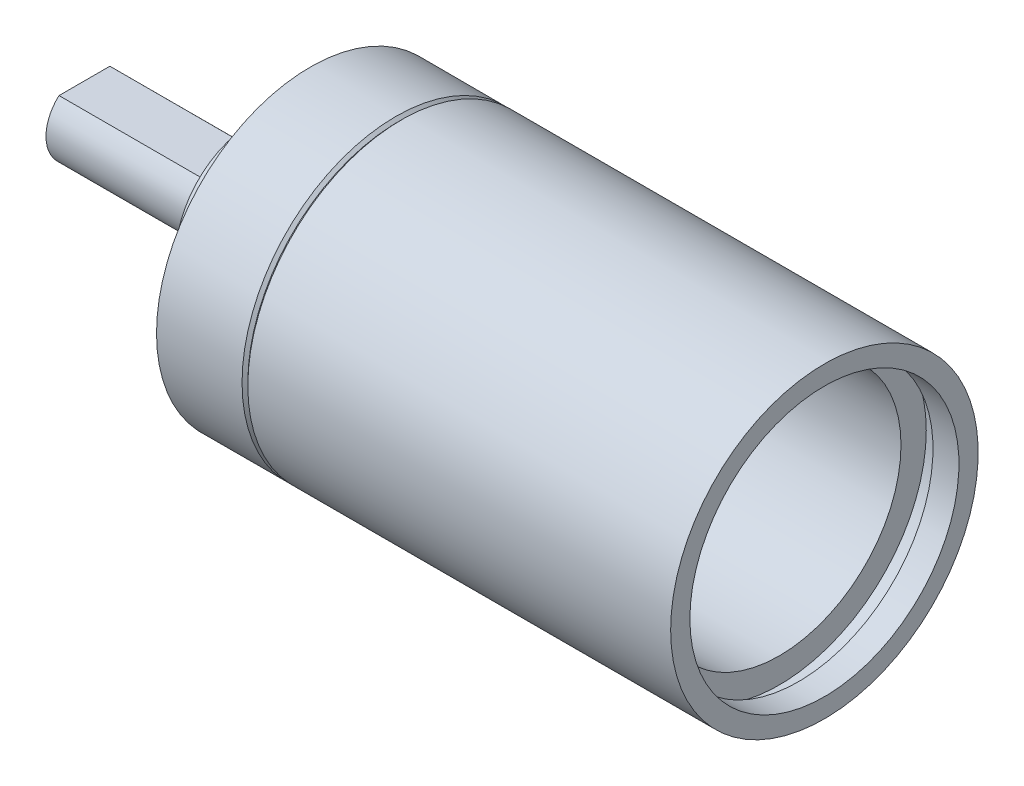
ISO-10303-21;
HEADER;
FILE_DESCRIPTION(('STEP AP214'),'2;1');
FILE_NAME('part.step','',(''),(''),'','','');
FILE_SCHEMA(('AUTOMOTIVE_DESIGN { 1 0 10303 214 1 1 1 1 }'));
ENDSEC;
DATA;
#1=APPLICATION_CONTEXT('core data for automotive mechanical design processes');
#2=APPLICATION_PROTOCOL_DEFINITION('international standard','automotive_design',2000,#1);
#3=PRODUCT_CONTEXT('',#1,'mechanical');
#4=PRODUCT('Part','Part','',(#3));
#5=PRODUCT_RELATED_PRODUCT_CATEGORY('part','',(#4));
#6=PRODUCT_DEFINITION_FORMATION('','',#4);
#7=PRODUCT_DEFINITION_CONTEXT('part definition',#1,'design');
#8=PRODUCT_DEFINITION('design','',#6,#7);
#9=PRODUCT_DEFINITION_SHAPE('','',#8);
#10=(LENGTH_UNIT() NAMED_UNIT(*) SI_UNIT(.MILLI.,.METRE.));
#11=(NAMED_UNIT(*) PLANE_ANGLE_UNIT() SI_UNIT($,.RADIAN.));
#12=(NAMED_UNIT(*) SI_UNIT($,.STERADIAN.) SOLID_ANGLE_UNIT());
#13=UNCERTAINTY_MEASURE_WITH_UNIT(LENGTH_MEASURE(1.E-05),#10,'distance_accuracy_value','');
#14=(GEOMETRIC_REPRESENTATION_CONTEXT(3) GLOBAL_UNCERTAINTY_ASSIGNED_CONTEXT((#13)) GLOBAL_UNIT_ASSIGNED_CONTEXT((#10,
#11,#12)) REPRESENTATION_CONTEXT('',''));
#15=CARTESIAN_POINT('',(0.,0.,0.));
#16=DIRECTION('',(0.,0.,1.));
#17=DIRECTION('',(1.,0.,0.));
#18=AXIS2_PLACEMENT_3D('',#15,#16,#17);
#19=CARTESIAN_POINT('',(-38.5000000000001,0.,0.));
#20=DIRECTION('',(-1.,0.,0.));
#21=DIRECTION('',(0.,0.,1.));
#22=AXIS2_PLACEMENT_3D('',#19,#20,#21);
#23=PLANE('',#22);
#24=CARTESIAN_POINT('',(-38.5000000000001,0.,0.));
#25=DIRECTION('',(-1.,0.,0.));
#26=DIRECTION('',(0.,0.,1.));
#27=AXIS2_PLACEMENT_3D('',#24,#25,#26);
#28=CIRCLE('',#27,2.);
#29=CARTESIAN_POINT('',(-38.5,1.50000000000003,1.32287565553226));
#30=VERTEX_POINT('',#29);
#31=CARTESIAN_POINT('',(-38.5,1.50000000000002,-1.32287565553225));
#32=VERTEX_POINT('',#31);
#33=EDGE_CURVE('E18',#30,#32,#28,.F.);
#34=ORIENTED_EDGE('',*,*,#33,.F.);
#35=DIRECTION('',(0.,0.,-1.));
#36=VECTOR('',#35,1.);
#37=CARTESIAN_POINT('',(-38.5,1.5,5.));
#38=LINE('',#37,#36);
#39=EDGE_CURVE('E56',#30,#32,#38,.T.);
#40=ORIENTED_EDGE('',*,*,#39,.T.);
#41=EDGE_LOOP('',(#34,#40));
#42=FACE_BOUND('',#41,.T.);
#43=ADVANCED_FACE('F15',(#42),#23,.T.);
#44=CARTESIAN_POINT('',(-30.5,1.5,5.));
#45=DIRECTION('',(0.707106781186547,-0.707106781186548,0.));
#46=DIRECTION('',(0.707106781186548,0.707106781186547,0.));
#47=AXIS2_PLACEMENT_3D('',#44,#45,#46);
#48=PLANE('',#47);
#49=DIRECTION('',(0.,0.,-1.));
#50=VECTOR('',#49,1.);
#51=CARTESIAN_POINT('',(-30.5,1.5,5.));
#52=LINE('',#51,#50);
#53=CARTESIAN_POINT('',(-30.4999999999999,1.50000000000004,-1.32287565553225));
#54=VERTEX_POINT('',#53);
#55=CARTESIAN_POINT('',(-30.4999999999999,1.50000000000003,1.32287565553226));
#56=VERTEX_POINT('',#55);
#57=EDGE_CURVE('E67',#54,#56,#52,.F.);
#58=ORIENTED_EDGE('',*,*,#57,.T.);
#59=CARTESIAN_POINT('',(-32.,0.,0.));
#60=DIRECTION('',(0.707106781186547,-0.707106781186548,0.));
#61=DIRECTION('',(-0.707106781186548,-0.707106781186547,0.));
#62=AXIS2_PLACEMENT_3D('',#59,#60,#61);
#63=ELLIPSE('',#62,2.82842712474619,2.);
#64=EDGE_CURVE('E71',#54,#56,#63,.T.);
#65=ORIENTED_EDGE('',*,*,#64,.F.);
#66=EDGE_LOOP('',(#58,#65));
#67=FACE_BOUND('',#66,.T.);
#68=ADVANCED_FACE('F154',(#67),#48,.F.);
#69=CARTESIAN_POINT('',(-38.5,1.5,5.));
#70=DIRECTION('',(0.,-1.,0.));
#71=DIRECTION('',(0.,0.,-1.));
#72=AXIS2_PLACEMENT_3D('',#69,#70,#71);
#73=PLANE('',#72);
#74=ORIENTED_EDGE('',*,*,#39,.F.);
#75=DIRECTION('',(-1.,0.,0.));
#76=VECTOR('',#75,1.);
#77=CARTESIAN_POINT('',(1.92499999999995,1.50000000000007,1.32287565553222));
#78=LINE('',#77,#76);
#79=EDGE_CURVE('E65',#56,#30,#78,.T.);
#80=ORIENTED_EDGE('',*,*,#79,.F.);
#81=ORIENTED_EDGE('',*,*,#57,.F.);
#82=DIRECTION('',(-1.,0.,0.));
#83=VECTOR('',#82,1.);
#84=CARTESIAN_POINT('',(1.92499999999995,1.50000000000007,-1.32287565553221));
#85=LINE('',#84,#83);
#86=EDGE_CURVE('E61',#32,#54,#85,.F.);
#87=ORIENTED_EDGE('',*,*,#86,.F.);
#88=EDGE_LOOP('',(#74,#80,#81,#87));
#89=FACE_BOUND('',#88,.T.);
#90=ADVANCED_FACE('F64',(#89),#73,.F.);
#91=CARTESIAN_POINT('',(1.92499999999995,0.,0.));
#92=DIRECTION('',(-1.,0.,0.));
#93=DIRECTION('',(0.,0.,1.));
#94=AXIS2_PLACEMENT_3D('',#91,#92,#93);
#95=CYLINDRICAL_SURFACE('',#94,2.);
#96=CARTESIAN_POINT('',(-29.7500000000001,0.,0.));
#97=DIRECTION('',(-1.,0.,0.));
#98=DIRECTION('',(0.,0.,1.));
#99=AXIS2_PLACEMENT_3D('',#96,#97,#98);
#100=CIRCLE('',#99,2.);
#101=CARTESIAN_POINT('',(-29.7500000000001,0.,2.00000000000001));
#102=VERTEX_POINT('',#101);
#103=EDGE_CURVE('E72',#102,#102,#100,.F.);
#104=ORIENTED_EDGE('',*,*,#103,.F.);
#105=EDGE_LOOP('',(#104));
#106=FACE_BOUND('',#105,.T.);
#107=ORIENTED_EDGE('',*,*,#79,.T.);
#108=ORIENTED_EDGE('',*,*,#33,.T.);
#109=ORIENTED_EDGE('',*,*,#86,.T.);
#110=ORIENTED_EDGE('',*,*,#64,.T.);
#111=EDGE_LOOP('',(#107,#108,#109,#110));
#112=FACE_BOUND('',#111,.T.);
#113=ADVANCED_FACE('F69',(#106,#112),#95,.T.);
#114=CARTESIAN_POINT('',(-29.7500000000001,0.,0.));
#115=DIRECTION('',(-1.,0.,0.));
#116=DIRECTION('',(0.,0.,1.));
#117=AXIS2_PLACEMENT_3D('',#114,#115,#116);
#118=PLANE('',#117);
#119=CARTESIAN_POINT('',(-29.7500000000001,0.,0.));
#120=DIRECTION('',(-1.,0.,0.));
#121=DIRECTION('',(0.,0.,1.));
#122=AXIS2_PLACEMENT_3D('',#119,#120,#121);
#123=CIRCLE('',#122,4.);
#124=CARTESIAN_POINT('',(-29.7500000000001,0.,4.00000000000001));
#125=VERTEX_POINT('',#124);
#126=EDGE_CURVE('E75',#125,#125,#123,.F.);
#127=ORIENTED_EDGE('',*,*,#126,.F.);
#128=EDGE_LOOP('',(#127));
#129=FACE_BOUND('',#128,.T.);
#130=ORIENTED_EDGE('',*,*,#103,.T.);
#131=EDGE_LOOP('',(#130));
#132=FACE_BOUND('',#131,.T.);
#133=ADVANCED_FACE('F141',(#129,#132),#118,.T.);
#134=CARTESIAN_POINT('',(-21.7000000000001,0.,0.));
#135=DIRECTION('',(-1.,0.,0.));
#136=DIRECTION('',(0.,0.,1.));
#137=AXIS2_PLACEMENT_3D('',#134,#135,#136);
#138=PLANE('',#137);
#139=CARTESIAN_POINT('',(-21.7000000000001,0.,0.));
#140=DIRECTION('',(-1.,0.,0.));
#141=DIRECTION('',(0.,0.,1.));
#142=AXIS2_PLACEMENT_3D('',#139,#140,#141);
#143=CIRCLE('',#142,6.335);
#144=CARTESIAN_POINT('',(-21.7000000000001,0.,6.335));
#145=VERTEX_POINT('',#144);
#146=EDGE_CURVE('E133',#145,#145,#143,.F.);
#147=ORIENTED_EDGE('',*,*,#146,.T.);
#148=EDGE_LOOP('',(#147));
#149=FACE_BOUND('',#148,.T.);
#150=ADVANCED_FACE('F144',(#149),#138,.F.);
#151=CARTESIAN_POINT('',(1.92499999999995,0.,0.));
#152=DIRECTION('',(-1.,0.,0.));
#153=DIRECTION('',(0.,0.,1.));
#154=AXIS2_PLACEMENT_3D('',#151,#152,#153);
#155=CYLINDRICAL_SURFACE('',#154,4.);
#156=CARTESIAN_POINT('',(-27.9,0.,0.));
#157=DIRECTION('',(-1.,0.,0.));
#158=DIRECTION('',(0.,0.,1.));
#159=AXIS2_PLACEMENT_3D('',#156,#157,#158);
#160=CIRCLE('',#159,4.);
#161=CARTESIAN_POINT('',(-27.9,0.,4.00000000000001));
#162=VERTEX_POINT('',#161);
#163=EDGE_CURVE('E130',#162,#162,#160,.F.);
#164=ORIENTED_EDGE('',*,*,#163,.F.);
#165=EDGE_LOOP('',(#164));
#166=FACE_BOUND('',#165,.T.);
#167=ORIENTED_EDGE('',*,*,#126,.T.);
#168=EDGE_LOOP('',(#167));
#169=FACE_BOUND('',#168,.T.);
#170=ADVANCED_FACE('F139',(#166,#169),#155,.T.);
#171=CARTESIAN_POINT('',(1.92499999999995,0.,0.));
#172=DIRECTION('',(-1.,0.,0.));
#173=DIRECTION('',(0.,0.,1.));
#174=AXIS2_PLACEMENT_3D('',#171,#172,#173);
#175=CYLINDRICAL_SURFACE('',#174,6.335);
#176=CARTESIAN_POINT('',(-2.35000000000002,0.,0.));
#177=DIRECTION('',(-1.,0.,0.));
#178=DIRECTION('',(0.,0.,1.));
#179=AXIS2_PLACEMENT_3D('',#176,#177,#178);
#180=CIRCLE('',#179,6.335);
#181=CARTESIAN_POINT('',(-2.35000000000002,0.,6.33500000000001));
#182=VERTEX_POINT('',#181);
#183=EDGE_CURVE('E127',#182,#182,#180,.F.);
#184=ORIENTED_EDGE('',*,*,#183,.T.);
#185=EDGE_LOOP('',(#184));
#186=FACE_BOUND('',#185,.T.);
#187=ORIENTED_EDGE('',*,*,#146,.F.);
#188=EDGE_LOOP('',(#187));
#189=FACE_BOUND('',#188,.T.);
#190=ADVANCED_FACE('F254',(#186,#189),#175,.F.);
#191=CARTESIAN_POINT('',(-22.872748738564,3.25,5.629165124599));
#192=DIRECTION('',(-1.,0.,0.));
#193=DIRECTION('',(0.,0.,1.));
#194=AXIS2_PLACEMENT_3D('',#191,#192,#193);
#195=CONICAL_SURFACE('',#194,0.870000000002384,1.02974425843473);
#196=CARTESIAN_POINT('',(-22.349999999733,3.25,5.62916512447487));
#197=VERTEX_POINT('',#196);
#198=VERTEX_LOOP('',#197);
#199=FACE_BOUND('',#198,.T.);
#200=CARTESIAN_POINT('',(-22.8727487385501,3.25,5.629165124599));
#201=DIRECTION('',(1.,0.,0.));
#202=DIRECTION('',(0.,0.,-1.));
#203=AXIS2_PLACEMENT_3D('',#200,#201,#202);
#204=CIRCLE('',#203,0.87);
#205=CARTESIAN_POINT('',(-22.8727487385501,3.25,4.759165124599));
#206=VERTEX_POINT('',#205);
#207=EDGE_CURVE('E79',#206,#206,#204,.F.);
#208=ORIENTED_EDGE('',*,*,#207,.T.);
#209=EDGE_LOOP('',(#208));
#210=FACE_BOUND('',#209,.T.);
#211=ADVANCED_FACE('F250',(#199,#210),#195,.F.);
#212=CARTESIAN_POINT('',(-22.872748738564,-3.25,5.62916512459901));
#213=DIRECTION('',(-1.,0.,0.));
#214=DIRECTION('',(0.,0.,1.));
#215=AXIS2_PLACEMENT_3D('',#212,#213,#214);
#216=CONICAL_SURFACE('',#215,0.870000000002387,1.02974425843474);
#217=CARTESIAN_POINT('',(-22.349999999733,-3.25,5.62916512459901));
#218=VERTEX_POINT('',#217);
#219=VERTEX_LOOP('',#218);
#220=FACE_BOUND('',#219,.T.);
#221=CARTESIAN_POINT('',(-22.8727487385501,-3.25000000000001,5.629165124599));
#222=DIRECTION('',(1.,0.,0.));
#223=DIRECTION('',(0.,0.,-1.));
#224=AXIS2_PLACEMENT_3D('',#221,#222,#223);
#225=CIRCLE('',#224,0.87);
#226=CARTESIAN_POINT('',(-22.8727487385501,-3.25000000000001,4.759165124599));
#227=VERTEX_POINT('',#226);
#228=EDGE_CURVE('E507',#227,#227,#225,.F.);
#229=ORIENTED_EDGE('',*,*,#228,.T.);
#230=EDGE_LOOP('',(#229));
#231=FACE_BOUND('',#230,.T.);
#232=ADVANCED_FACE('F246',(#220,#231),#216,.F.);
#233=CARTESIAN_POINT('',(-22.8727487385072,-6.5,0.));
#234=DIRECTION('',(-1.,0.,0.));
#235=DIRECTION('',(0.,0.,1.));
#236=AXIS2_PLACEMENT_3D('',#233,#234,#235);
#237=CONICAL_SURFACE('',#236,0.869999999906668,1.02974425821274);
#238=CARTESIAN_POINT('',(-22.3499999996193,-6.5,0.));
#239=VERTEX_POINT('',#238);
#240=VERTEX_LOOP('',#239);
#241=FACE_BOUND('',#240,.T.);
#242=CARTESIAN_POINT('',(-22.8727487385501,-6.5,0.));
#243=DIRECTION('',(1.,0.,0.));
#244=DIRECTION('',(0.,0.,-1.));
#245=AXIS2_PLACEMENT_3D('',#242,#243,#244);
#246=CIRCLE('',#245,0.87);
#247=CARTESIAN_POINT('',(-22.8727487385501,-6.5,-0.869999999999986));
#248=VERTEX_POINT('',#247);
#249=EDGE_CURVE('E509',#248,#248,#246,.F.);
#250=ORIENTED_EDGE('',*,*,#249,.T.);
#251=EDGE_LOOP('',(#250));
#252=FACE_BOUND('',#251,.T.);
#253=ADVANCED_FACE('F242',(#241,#252),#237,.F.);
#254=CARTESIAN_POINT('',(-22.8727487386209,-3.25,-5.62916512459899));
#255=DIRECTION('',(-1.,0.,0.));
#256=DIRECTION('',(0.,0.,1.));
#257=AXIS2_PLACEMENT_3D('',#254,#255,#256);
#258=CONICAL_SURFACE('',#257,0.869999999981497,1.02974425833669);
#259=CARTESIAN_POINT('',(-22.3499999997614,-3.25,-5.62916512467382));
#260=VERTEX_POINT('',#259);
#261=VERTEX_LOOP('',#260);
#262=FACE_BOUND('',#261,.T.);
#263=CARTESIAN_POINT('',(-22.8727487385501,-3.25000000000001,-5.629165124599));
#264=DIRECTION('',(1.,0.,0.));
#265=DIRECTION('',(0.,0.,-1.));
#266=AXIS2_PLACEMENT_3D('',#263,#264,#265);
#267=CIRCLE('',#266,0.87);
#268=CARTESIAN_POINT('',(-22.8727487385501,-3.25000000000001,-6.499165124599));
#269=VERTEX_POINT('',#268);
#270=EDGE_CURVE('E513',#269,#269,#267,.F.);
#271=ORIENTED_EDGE('',*,*,#270,.T.);
#272=EDGE_LOOP('',(#271));
#273=FACE_BOUND('',#272,.T.);
#274=ADVANCED_FACE('F238',(#262,#273),#258,.F.);
#275=CARTESIAN_POINT('',(-22.8727487386209,3.25,-5.629165124599));
#276=DIRECTION('',(-1.,0.,0.));
#277=DIRECTION('',(0.,0.,1.));
#278=AXIS2_PLACEMENT_3D('',#275,#276,#277);
#279=CONICAL_SURFACE('',#278,0.86999999998149,1.02974425833668);
#280=CARTESIAN_POINT('',(-22.3499999997898,3.25,-5.629165124599));
#281=VERTEX_POINT('',#280);
#282=VERTEX_LOOP('',#281);
#283=FACE_BOUND('',#282,.T.);
#284=CARTESIAN_POINT('',(-22.8727487385501,3.25,-5.62916512459898));
#285=DIRECTION('',(1.,0.,0.));
#286=DIRECTION('',(0.,0.,-1.));
#287=AXIS2_PLACEMENT_3D('',#284,#285,#286);
#288=CIRCLE('',#287,0.87);
#289=CARTESIAN_POINT('',(-22.8727487385501,3.25,-6.49916512459898));
#290=VERTEX_POINT('',#289);
#291=EDGE_CURVE('E518',#290,#290,#288,.F.);
#292=ORIENTED_EDGE('',*,*,#291,.T.);
#293=EDGE_LOOP('',(#292));
#294=FACE_BOUND('',#293,.T.);
#295=ADVANCED_FACE('F235',(#283,#294),#279,.F.);
#296=CARTESIAN_POINT('',(-22.8727487385072,6.5,0.));
#297=DIRECTION('',(-1.,0.,0.));
#298=DIRECTION('',(0.,0.,1.));
#299=AXIS2_PLACEMENT_3D('',#296,#297,#298);
#300=CONICAL_SURFACE('',#299,0.869999999906675,1.02974425821274);
#301=CARTESIAN_POINT('',(-22.3499999995909,6.5,5.68503758913403E-11));
#302=VERTEX_POINT('',#301);
#303=VERTEX_LOOP('',#302);
#304=FACE_BOUND('',#303,.T.);
#305=CARTESIAN_POINT('',(-22.8727487385501,6.5,0.));
#306=DIRECTION('',(1.,0.,0.));
#307=DIRECTION('',(0.,0.,-1.));
#308=AXIS2_PLACEMENT_3D('',#305,#306,#307);
#309=CIRCLE('',#308,0.87);
#310=CARTESIAN_POINT('',(-22.8727487385501,6.5,-0.869999999999993));
#311=VERTEX_POINT('',#310);
#312=EDGE_CURVE('E126',#311,#311,#309,.F.);
#313=ORIENTED_EDGE('',*,*,#312,.T.);
#314=EDGE_LOOP('',(#313));
#315=FACE_BOUND('',#314,.T.);
#316=ADVANCED_FACE('F231',(#304,#315),#300,.F.);
#317=CARTESIAN_POINT('',(-27.9,0.,0.));
#318=DIRECTION('',(-1.,0.,0.));
#319=DIRECTION('',(0.,0.,1.));
#320=AXIS2_PLACEMENT_3D('',#317,#318,#319);
#321=PLANE('',#320);
#322=CARTESIAN_POINT('',(-27.9,0.,0.));
#323=DIRECTION('',(-1.,0.,0.));
#324=DIRECTION('',(0.,0.,1.));
#325=AXIS2_PLACEMENT_3D('',#322,#323,#324);
#326=CIRCLE('',#325,5.);
#327=CARTESIAN_POINT('',(-27.9,0.,5.00000000000001));
#328=VERTEX_POINT('',#327);
#329=EDGE_CURVE('E123',#328,#328,#326,.F.);
#330=ORIENTED_EDGE('',*,*,#329,.F.);
#331=EDGE_LOOP('',(#330));
#332=FACE_BOUND('',#331,.T.);
#333=ORIENTED_EDGE('',*,*,#163,.T.);
#334=EDGE_LOOP('',(#333));
#335=FACE_BOUND('',#334,.T.);
#336=ADVANCED_FACE('F227',(#332,#335),#321,.T.);
#337=CARTESIAN_POINT('',(-2.35000000000002,0.,0.));
#338=DIRECTION('',(-1.,0.,0.));
#339=DIRECTION('',(0.,0.,1.));
#340=AXIS2_PLACEMENT_3D('',#337,#338,#339);
#341=PLANE('',#340);
#342=CARTESIAN_POINT('',(-2.35000000000002,0.,0.));
#343=DIRECTION('',(-1.,0.,0.));
#344=DIRECTION('',(0.,0.,1.));
#345=AXIS2_PLACEMENT_3D('',#342,#343,#344);
#346=CIRCLE('',#345,7.65);
#347=CARTESIAN_POINT('',(-2.35000000000002,0.,7.65000000000001));
#348=VERTEX_POINT('',#347);
#349=EDGE_CURVE('E120',#348,#348,#346,.F.);
#350=ORIENTED_EDGE('',*,*,#349,.T.);
#351=EDGE_LOOP('',(#350));
#352=FACE_BOUND('',#351,.T.);
#353=ORIENTED_EDGE('',*,*,#183,.F.);
#354=EDGE_LOOP('',(#353));
#355=FACE_BOUND('',#354,.T.);
#356=ADVANCED_FACE('F223',(#352,#355),#341,.F.);
#357=CARTESIAN_POINT('',(-26.97,3.25,5.629165124599));
#358=DIRECTION('',(1.,0.,0.));
#359=DIRECTION('',(0.,0.,-1.));
#360=AXIS2_PLACEMENT_3D('',#357,#358,#359);
#361=CYLINDRICAL_SURFACE('',#360,0.87);
#362=CARTESIAN_POINT('',(-26.75,3.25,5.629165124599));
#363=DIRECTION('',(1.,0.,0.));
#364=DIRECTION('',(0.,0.,-1.));
#365=AXIS2_PLACEMENT_3D('',#362,#363,#364);
#366=CIRCLE('',#365,0.87);
#367=CARTESIAN_POINT('',(-26.75,3.25,4.759165124599));
#368=VERTEX_POINT('',#367);
#369=EDGE_CURVE('E117',#368,#368,#366,.T.);
#370=ORIENTED_EDGE('',*,*,#369,.F.);
#371=EDGE_LOOP('',(#370));
#372=FACE_BOUND('',#371,.T.);
#373=ORIENTED_EDGE('',*,*,#207,.F.);
#374=EDGE_LOOP('',(#373));
#375=FACE_BOUND('',#374,.T.);
#376=ADVANCED_FACE('F219',(#372,#375),#361,.F.);
#377=CARTESIAN_POINT('',(-26.97,-3.25000000000001,5.629165124599));
#378=DIRECTION('',(1.,0.,0.));
#379=DIRECTION('',(0.,0.,-1.));
#380=AXIS2_PLACEMENT_3D('',#377,#378,#379);
#381=CYLINDRICAL_SURFACE('',#380,0.87);
#382=CARTESIAN_POINT('',(-26.75,-3.25000000000001,5.629165124599));
#383=DIRECTION('',(1.,0.,0.));
#384=DIRECTION('',(0.,0.,-1.));
#385=AXIS2_PLACEMENT_3D('',#382,#383,#384);
#386=CIRCLE('',#385,0.87);
#387=CARTESIAN_POINT('',(-26.75,-3.25000000000001,4.759165124599));
#388=VERTEX_POINT('',#387);
#389=EDGE_CURVE('E114',#388,#388,#386,.T.);
#390=ORIENTED_EDGE('',*,*,#389,.F.);
#391=EDGE_LOOP('',(#390));
#392=FACE_BOUND('',#391,.T.);
#393=ORIENTED_EDGE('',*,*,#228,.F.);
#394=EDGE_LOOP('',(#393));
#395=FACE_BOUND('',#394,.T.);
#396=ADVANCED_FACE('F215',(#392,#395),#381,.F.);
#397=CARTESIAN_POINT('',(-26.97,-6.5,0.));
#398=DIRECTION('',(1.,0.,0.));
#399=DIRECTION('',(0.,0.,-1.));
#400=AXIS2_PLACEMENT_3D('',#397,#398,#399);
#401=CYLINDRICAL_SURFACE('',#400,0.87);
#402=CARTESIAN_POINT('',(-26.75,-6.5,0.));
#403=DIRECTION('',(1.,0.,0.));
#404=DIRECTION('',(0.,0.,-1.));
#405=AXIS2_PLACEMENT_3D('',#402,#403,#404);
#406=CIRCLE('',#405,0.87);
#407=CARTESIAN_POINT('',(-26.75,-6.5,-0.869999999999986));
#408=VERTEX_POINT('',#407);
#409=EDGE_CURVE('E111',#408,#408,#406,.T.);
#410=ORIENTED_EDGE('',*,*,#409,.F.);
#411=EDGE_LOOP('',(#410));
#412=FACE_BOUND('',#411,.T.);
#413=ORIENTED_EDGE('',*,*,#249,.F.);
#414=EDGE_LOOP('',(#413));
#415=FACE_BOUND('',#414,.T.);
#416=ADVANCED_FACE('F211',(#412,#415),#401,.F.);
#417=CARTESIAN_POINT('',(-26.97,-3.25000000000001,-5.629165124599));
#418=DIRECTION('',(1.,0.,0.));
#419=DIRECTION('',(0.,0.,-1.));
#420=AXIS2_PLACEMENT_3D('',#417,#418,#419);
#421=CYLINDRICAL_SURFACE('',#420,0.87);
#422=CARTESIAN_POINT('',(-26.75,-3.25000000000001,-5.629165124599));
#423=DIRECTION('',(1.,0.,0.));
#424=DIRECTION('',(0.,0.,-1.));
#425=AXIS2_PLACEMENT_3D('',#422,#423,#424);
#426=CIRCLE('',#425,0.87);
#427=CARTESIAN_POINT('',(-26.75,-3.25000000000001,-6.499165124599));
#428=VERTEX_POINT('',#427);
#429=EDGE_CURVE('E108',#428,#428,#426,.T.);
#430=ORIENTED_EDGE('',*,*,#429,.F.);
#431=EDGE_LOOP('',(#430));
#432=FACE_BOUND('',#431,.T.);
#433=ORIENTED_EDGE('',*,*,#270,.F.);
#434=EDGE_LOOP('',(#433));
#435=FACE_BOUND('',#434,.T.);
#436=ADVANCED_FACE('F207',(#432,#435),#421,.F.);
#437=CARTESIAN_POINT('',(-26.97,3.25,-5.62916512459898));
#438=DIRECTION('',(1.,0.,0.));
#439=DIRECTION('',(0.,0.,-1.));
#440=AXIS2_PLACEMENT_3D('',#437,#438,#439);
#441=CYLINDRICAL_SURFACE('',#440,0.87);
#442=CARTESIAN_POINT('',(-26.75,3.25,-5.62916512459898));
#443=DIRECTION('',(1.,0.,0.));
#444=DIRECTION('',(0.,0.,-1.));
#445=AXIS2_PLACEMENT_3D('',#442,#443,#444);
#446=CIRCLE('',#445,0.87);
#447=CARTESIAN_POINT('',(-26.75,3.25,-6.49916512459898));
#448=VERTEX_POINT('',#447);
#449=EDGE_CURVE('E105',#448,#448,#446,.T.);
#450=ORIENTED_EDGE('',*,*,#449,.F.);
#451=EDGE_LOOP('',(#450));
#452=FACE_BOUND('',#451,.T.);
#453=ORIENTED_EDGE('',*,*,#291,.F.);
#454=EDGE_LOOP('',(#453));
#455=FACE_BOUND('',#454,.T.);
#456=ADVANCED_FACE('F203',(#452,#455),#441,.F.);
#457=CARTESIAN_POINT('',(-26.97,6.5,0.));
#458=DIRECTION('',(1.,0.,0.));
#459=DIRECTION('',(0.,0.,-1.));
#460=AXIS2_PLACEMENT_3D('',#457,#458,#459);
#461=CYLINDRICAL_SURFACE('',#460,0.87);
#462=CARTESIAN_POINT('',(-26.75,6.5,0.));
#463=DIRECTION('',(1.,0.,0.));
#464=DIRECTION('',(0.,0.,-1.));
#465=AXIS2_PLACEMENT_3D('',#462,#463,#464);
#466=CIRCLE('',#465,0.87);
#467=CARTESIAN_POINT('',(-26.75,6.5,-0.869999999999993));
#468=VERTEX_POINT('',#467);
#469=EDGE_CURVE('E102',#468,#468,#466,.T.);
#470=ORIENTED_EDGE('',*,*,#469,.F.);
#471=EDGE_LOOP('',(#470));
#472=FACE_BOUND('',#471,.T.);
#473=ORIENTED_EDGE('',*,*,#312,.F.);
#474=EDGE_LOOP('',(#473));
#475=FACE_BOUND('',#474,.T.);
#476=ADVANCED_FACE('F199',(#472,#475),#461,.F.);
#477=CARTESIAN_POINT('',(1.92499999999995,0.,0.));
#478=DIRECTION('',(-1.,0.,0.));
#479=DIRECTION('',(0.,0.,1.));
#480=AXIS2_PLACEMENT_3D('',#477,#478,#479);
#481=CYLINDRICAL_SURFACE('',#480,5.);
#482=CARTESIAN_POINT('',(-26.75,0.,0.));
#483=DIRECTION('',(-1.,0.,0.));
#484=DIRECTION('',(0.,0.,1.));
#485=AXIS2_PLACEMENT_3D('',#482,#483,#484);
#486=CIRCLE('',#485,5.);
#487=CARTESIAN_POINT('',(-26.75,0.,5.00000000000001));
#488=VERTEX_POINT('',#487);
#489=EDGE_CURVE('E99',#488,#488,#486,.F.);
#490=ORIENTED_EDGE('',*,*,#489,.F.);
#491=EDGE_LOOP('',(#490));
#492=FACE_BOUND('',#491,.T.);
#493=ORIENTED_EDGE('',*,*,#329,.T.);
#494=EDGE_LOOP('',(#493));
#495=FACE_BOUND('',#494,.T.);
#496=ADVANCED_FACE('F195',(#492,#495),#481,.T.);
#497=CARTESIAN_POINT('',(1.92499999999995,0.,0.));
#498=DIRECTION('',(-1.,0.,0.));
#499=DIRECTION('',(0.,0.,1.));
#500=AXIS2_PLACEMENT_3D('',#497,#498,#499);
#501=CYLINDRICAL_SURFACE('',#500,7.65);
#502=CARTESIAN_POINT('',(-1.35000000000002,0.,0.));
#503=DIRECTION('',(-1.,0.,0.));
#504=DIRECTION('',(0.,0.,1.));
#505=AXIS2_PLACEMENT_3D('',#502,#503,#504);
#506=CIRCLE('',#505,7.65);
#507=CARTESIAN_POINT('',(-1.35000000000002,0.,7.65000000000001));
#508=VERTEX_POINT('',#507);
#509=EDGE_CURVE('E96',#508,#508,#506,.T.);
#510=ORIENTED_EDGE('',*,*,#509,.F.);
#511=EDGE_LOOP('',(#510));
#512=FACE_BOUND('',#511,.T.);
#513=ORIENTED_EDGE('',*,*,#349,.F.);
#514=EDGE_LOOP('',(#513));
#515=FACE_BOUND('',#514,.T.);
#516=ADVANCED_FACE('F191',(#512,#515),#501,.F.);
#517=CARTESIAN_POINT('',(-26.75,0.,0.));
#518=DIRECTION('',(-1.,0.,0.));
#519=DIRECTION('',(0.,0.,1.));
#520=AXIS2_PLACEMENT_3D('',#517,#518,#519);
#521=PLANE('',#520);
#522=CARTESIAN_POINT('',(-26.75,0.,0.));
#523=DIRECTION('',(-1.,0.,0.));
#524=DIRECTION('',(0.,0.,1.));
#525=AXIS2_PLACEMENT_3D('',#522,#523,#524);
#526=CIRCLE('',#525,8.);
#527=CARTESIAN_POINT('',(-26.75,0.,8.));
#528=VERTEX_POINT('',#527);
#529=EDGE_CURVE('E93',#528,#528,#526,.F.);
#530=ORIENTED_EDGE('',*,*,#529,.F.);
#531=EDGE_LOOP('',(#530));
#532=FACE_BOUND('',#531,.T.);
#533=ORIENTED_EDGE('',*,*,#489,.T.);
#534=EDGE_LOOP('',(#533));
#535=FACE_BOUND('',#534,.T.);
#536=ORIENTED_EDGE('',*,*,#469,.T.);
#537=EDGE_LOOP('',(#536));
#538=FACE_BOUND('',#537,.T.);
#539=ORIENTED_EDGE('',*,*,#449,.T.);
#540=EDGE_LOOP('',(#539));
#541=FACE_BOUND('',#540,.T.);
#542=ORIENTED_EDGE('',*,*,#429,.T.);
#543=EDGE_LOOP('',(#542));
#544=FACE_BOUND('',#543,.T.);
#545=ORIENTED_EDGE('',*,*,#409,.T.);
#546=EDGE_LOOP('',(#545));
#547=FACE_BOUND('',#546,.T.);
#548=ORIENTED_EDGE('',*,*,#389,.T.);
#549=EDGE_LOOP('',(#548));
#550=FACE_BOUND('',#549,.T.);
#551=ORIENTED_EDGE('',*,*,#369,.T.);
#552=EDGE_LOOP('',(#551));
#553=FACE_BOUND('',#552,.T.);
#554=ADVANCED_FACE('F187',(#532,#535,#538,#541,#544,#547,#550,#553),#521,.T.);
#555=CARTESIAN_POINT('',(-1.35000000000002,0.,0.));
#556=DIRECTION('',(-1.,0.,0.));
#557=DIRECTION('',(0.,0.,1.));
#558=AXIS2_PLACEMENT_3D('',#555,#556,#557);
#559=PLANE('',#558);
#560=ORIENTED_EDGE('',*,*,#509,.T.);
#561=EDGE_LOOP('',(#560));
#562=FACE_BOUND('',#561,.T.);
#563=CARTESIAN_POINT('',(-1.35000000000002,0.,0.));
#564=DIRECTION('',(-1.,0.,0.));
#565=DIRECTION('',(0.,0.,1.));
#566=AXIS2_PLACEMENT_3D('',#563,#564,#565);
#567=CIRCLE('',#566,7.);
#568=CARTESIAN_POINT('',(-1.35000000000002,0.,7.00000000000001));
#569=VERTEX_POINT('',#568);
#570=EDGE_CURVE('E90',#569,#569,#567,.F.);
#571=ORIENTED_EDGE('',*,*,#570,.T.);
#572=EDGE_LOOP('',(#571));
#573=FACE_BOUND('',#572,.T.);
#574=ADVANCED_FACE('F183',(#562,#573),#559,.T.);
#575=CARTESIAN_POINT('',(1.92499999999995,0.,0.));
#576=DIRECTION('',(-1.,0.,0.));
#577=DIRECTION('',(0.,0.,1.));
#578=AXIS2_PLACEMENT_3D('',#575,#576,#577);
#579=CYLINDRICAL_SURFACE('',#578,8.);
#580=ORIENTED_EDGE('',*,*,#529,.T.);
#581=EDGE_LOOP('',(#580));
#582=FACE_BOUND('',#581,.T.);
#583=CARTESIAN_POINT('',(-22.3000000000001,0.,0.));
#584=DIRECTION('',(-1.,0.,0.));
#585=DIRECTION('',(0.,0.,-1.));
#586=AXIS2_PLACEMENT_3D('',#583,#584,#585);
#587=CIRCLE('',#586,7.99999999999999);
#588=CARTESIAN_POINT('',(-22.3000000000001,0.,-7.99999999999997));
#589=VERTEX_POINT('',#588);
#590=EDGE_CURVE('E89',#589,#589,#587,.F.);
#591=ORIENTED_EDGE('',*,*,#590,.F.);
#592=EDGE_LOOP('',(#591));
#593=FACE_BOUND('',#592,.T.);
#594=ADVANCED_FACE('F179',(#582,#593),#579,.T.);
#595=CARTESIAN_POINT('',(1.92499999999995,0.,0.));
#596=DIRECTION('',(-1.,0.,0.));
#597=DIRECTION('',(0.,0.,1.));
#598=AXIS2_PLACEMENT_3D('',#595,#596,#597);
#599=CYLINDRICAL_SURFACE('',#598,7.);
#600=CARTESIAN_POINT('',(0.,0.,0.));
#601=DIRECTION('',(-1.,0.,0.));
#602=DIRECTION('',(0.,0.,1.));
#603=AXIS2_PLACEMENT_3D('',#600,#601,#602);
#604=CIRCLE('',#603,7.);
#605=CARTESIAN_POINT('',(0.,0.,7.00000000000001));
#606=VERTEX_POINT('',#605);
#607=EDGE_CURVE('E86',#606,#606,#604,.F.);
#608=ORIENTED_EDGE('',*,*,#607,.T.);
#609=EDGE_LOOP('',(#608));
#610=FACE_BOUND('',#609,.T.);
#611=ORIENTED_EDGE('',*,*,#570,.F.);
#612=EDGE_LOOP('',(#611));
#613=FACE_BOUND('',#612,.T.);
#614=ADVANCED_FACE('F175',(#610,#613),#599,.F.);
#615=CARTESIAN_POINT('',(-22.3000000000001,0.,0.));
#616=DIRECTION('',(-1.,0.,0.));
#617=DIRECTION('',(0.,0.,1.));
#618=AXIS2_PLACEMENT_3D('',#615,#616,#617);
#619=CONICAL_SURFACE('',#618,7.99999999999999,0.785398163397298);
#620=ORIENTED_EDGE('',*,*,#590,.T.);
#621=EDGE_LOOP('',(#620));
#622=FACE_BOUND('',#621,.T.);
#623=CARTESIAN_POINT('',(-22.1500000000001,0.,0.));
#624=DIRECTION('',(1.,0.,0.));
#625=DIRECTION('',(0.,0.,1.));
#626=AXIS2_PLACEMENT_3D('',#623,#624,#625);
#627=CIRCLE('',#626,7.85);
#628=CARTESIAN_POINT('',(-22.1500000000001,0.,7.85000000000001));
#629=VERTEX_POINT('',#628);
#630=EDGE_CURVE('E85',#629,#629,#627,.T.);
#631=ORIENTED_EDGE('',*,*,#630,.F.);
#632=EDGE_LOOP('',(#631));
#633=FACE_BOUND('',#632,.T.);
#634=ADVANCED_FACE('F171',(#622,#633),#619,.T.);
#635=CARTESIAN_POINT('',(0.,0.,0.));
#636=DIRECTION('',(-1.,0.,0.));
#637=DIRECTION('',(0.,0.,1.));
#638=AXIS2_PLACEMENT_3D('',#635,#636,#637);
#639=PLANE('',#638);
#640=CARTESIAN_POINT('',(0.,0.,0.));
#641=DIRECTION('',(-1.,0.,0.));
#642=DIRECTION('',(0.,0.,1.));
#643=AXIS2_PLACEMENT_3D('',#640,#641,#642);
#644=CIRCLE('',#643,8.);
#645=CARTESIAN_POINT('',(0.,0.,8.00000000000001));
#646=VERTEX_POINT('',#645);
#647=EDGE_CURVE('E24',#646,#646,#644,.T.);
#648=ORIENTED_EDGE('',*,*,#647,.F.);
#649=EDGE_LOOP('',(#648));
#650=FACE_BOUND('',#649,.T.);
#651=ORIENTED_EDGE('',*,*,#607,.F.);
#652=EDGE_LOOP('',(#651));
#653=FACE_BOUND('',#652,.T.);
#654=ADVANCED_FACE('F164',(#650,#653),#639,.F.);
#655=CARTESIAN_POINT('',(-22.,0.,0.));
#656=DIRECTION('',(1.,0.,0.));
#657=DIRECTION('',(0.,0.,-1.));
#658=AXIS2_PLACEMENT_3D('',#655,#656,#657);
#659=CONICAL_SURFACE('',#658,7.99999999999999,0.785398163397292);
#660=CARTESIAN_POINT('',(-22.,0.,0.));
#661=DIRECTION('',(-1.,0.,0.));
#662=DIRECTION('',(0.,0.,1.));
#663=AXIS2_PLACEMENT_3D('',#660,#661,#662);
#664=CIRCLE('',#663,8.);
#665=CARTESIAN_POINT('',(-22.,0.,8.00000000000001));
#666=VERTEX_POINT('',#665);
#667=EDGE_CURVE('E10',#666,#666,#664,.F.);
#668=ORIENTED_EDGE('',*,*,#667,.F.);
#669=EDGE_LOOP('',(#668));
#670=FACE_BOUND('',#669,.T.);
#671=ORIENTED_EDGE('',*,*,#630,.T.);
#672=EDGE_LOOP('',(#671));
#673=FACE_BOUND('',#672,.T.);
#674=ADVANCED_FACE('F158',(#670,#673),#659,.T.);
#675=CARTESIAN_POINT('',(1.92499999999995,0.,0.));
#676=DIRECTION('',(-1.,0.,0.));
#677=DIRECTION('',(0.,0.,1.));
#678=AXIS2_PLACEMENT_3D('',#675,#676,#677);
#679=CYLINDRICAL_SURFACE('',#678,8.);
#680=ORIENTED_EDGE('',*,*,#667,.T.);
#681=EDGE_LOOP('',(#680));
#682=FACE_BOUND('',#681,.T.);
#683=ORIENTED_EDGE('',*,*,#647,.T.);
#684=EDGE_LOOP('',(#683));
#685=FACE_BOUND('',#684,.T.);
#686=ADVANCED_FACE('F156',(#682,#685),#679,.T.);
#687=CLOSED_SHELL('',(#43,#68,#90,#113,#133,#150,#170,#190,#211,#232,#253,#274,#295,#316,#336,
#356,#376,#396,#416,#436,#456,#476,#496,#516,#554,#574,#594,#614,#634,#654,#674,#686));
#688=MANIFOLD_SOLID_BREP('B1',#687);
#689=ADVANCED_BREP_SHAPE_REPRESENTATION('',(#18,#688),#14);
#690=SHAPE_DEFINITION_REPRESENTATION(#9,#689);
ENDSEC;
END-ISO-10303-21;
